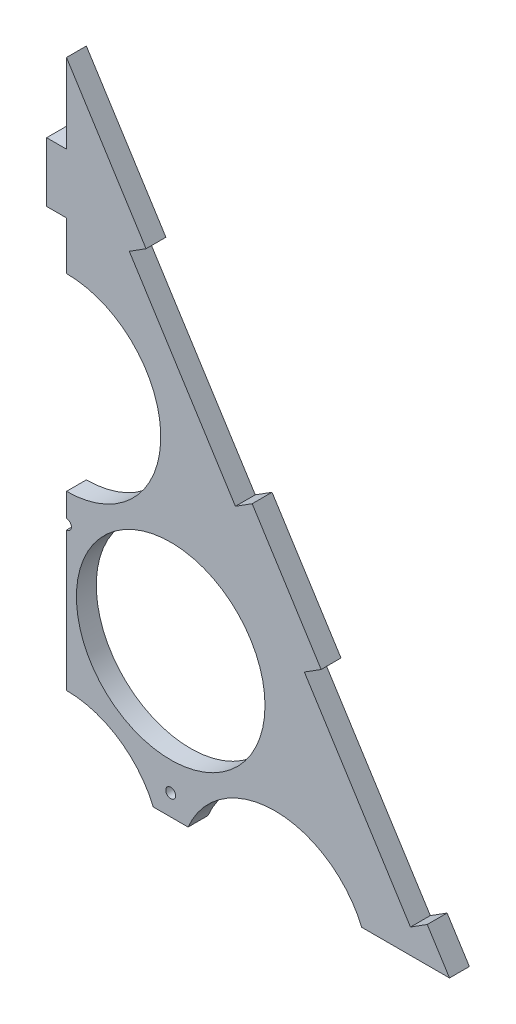
ISO-10303-21;
HEADER;
FILE_DESCRIPTION(('STEP AP214'),'2;1');
FILE_NAME('part.step','',(''),(''),'','','');
FILE_SCHEMA(('AUTOMOTIVE_DESIGN { 1 0 10303 214 1 1 1 1 }'));
ENDSEC;
DATA;
#1=APPLICATION_CONTEXT('core data for automotive mechanical design processes');
#2=APPLICATION_PROTOCOL_DEFINITION('international standard','automotive_design',2000,#1);
#3=PRODUCT_CONTEXT('',#1,'mechanical');
#4=PRODUCT('Part','Part','',(#3));
#5=PRODUCT_RELATED_PRODUCT_CATEGORY('part','',(#4));
#6=PRODUCT_DEFINITION_FORMATION('','',#4);
#7=PRODUCT_DEFINITION_CONTEXT('part definition',#1,'design');
#8=PRODUCT_DEFINITION('design','',#6,#7);
#9=PRODUCT_DEFINITION_SHAPE('','',#8);
#10=(LENGTH_UNIT() NAMED_UNIT(*) SI_UNIT(.MILLI.,.METRE.));
#11=(NAMED_UNIT(*) PLANE_ANGLE_UNIT() SI_UNIT($,.RADIAN.));
#12=(NAMED_UNIT(*) SI_UNIT($,.STERADIAN.) SOLID_ANGLE_UNIT());
#13=UNCERTAINTY_MEASURE_WITH_UNIT(LENGTH_MEASURE(1.E-05),#10,'distance_accuracy_value','');
#14=(GEOMETRIC_REPRESENTATION_CONTEXT(3) GLOBAL_UNCERTAINTY_ASSIGNED_CONTEXT((#13)) GLOBAL_UNIT_ASSIGNED_CONTEXT((#10,
#11,#12)) REPRESENTATION_CONTEXT('',''));
#15=CARTESIAN_POINT('',(0.,0.,0.));
#16=DIRECTION('',(0.,0.,1.));
#17=DIRECTION('',(1.,0.,0.));
#18=AXIS2_PLACEMENT_3D('',#15,#16,#17);
#19=CARTESIAN_POINT('',(0.,414.561180134828,0.));
#20=DIRECTION('',(1.,0.,0.));
#21=DIRECTION('',(0.,1.,0.));
#22=AXIS2_PLACEMENT_3D('',#19,#20,#21);
#23=PLANE('',#22);
#24=DIRECTION('',(0.,1.,0.));
#25=VECTOR('',#24,1.);
#26=CARTESIAN_POINT('',(0.,414.561180134828,10.));
#27=LINE('',#26,#25);
#28=CARTESIAN_POINT('',(0.,320.298002192098,10.));
#29=VERTEX_POINT('',#28);
#30=CARTESIAN_POINT('',(0.,344.561180134828,10.));
#31=VERTEX_POINT('',#30);
#32=EDGE_CURVE('E231',#29,#31,#27,.T.);
#33=ORIENTED_EDGE('',*,*,#32,.T.);
#34=DIRECTION('',(0.,0.,1.));
#35=VECTOR('',#34,1.);
#36=CARTESIAN_POINT('',(0.,344.561180134828,0.));
#37=LINE('',#36,#35);
#38=CARTESIAN_POINT('',(0.,344.561180134828,0.));
#39=VERTEX_POINT('',#38);
#40=EDGE_CURVE('E58',#39,#31,#37,.T.);
#41=ORIENTED_EDGE('',*,*,#40,.F.);
#42=DIRECTION('',(0.,1.,0.));
#43=VECTOR('',#42,1.);
#44=CARTESIAN_POINT('',(0.,414.561180134828,0.));
#45=LINE('',#44,#43);
#46=CARTESIAN_POINT('',(0.,320.298002192098,0.));
#47=VERTEX_POINT('',#46);
#48=EDGE_CURVE('E225',#47,#39,#45,.T.);
#49=ORIENTED_EDGE('',*,*,#48,.F.);
#50=DIRECTION('',(0.,0.,-1.));
#51=VECTOR('',#50,1.);
#52=CARTESIAN_POINT('',(0.,320.298002192098,10.));
#53=LINE('',#52,#51);
#54=EDGE_CURVE('E235',#47,#29,#53,.F.);
#55=ORIENTED_EDGE('',*,*,#54,.T.);
#56=EDGE_LOOP('',(#33,#41,#49,#55));
#57=FACE_BOUND('',#56,.T.);
#58=ADVANCED_FACE('F35',(#57),#23,.F.);
#59=CARTESIAN_POINT('',(0.,414.561180134828,10.));
#60=DIRECTION('',(-0.84517937784663,-0.53448275862069,0.));
#61=DIRECTION('',(0.53448275862069,-0.84517937784663,0.));
#62=AXIS2_PLACEMENT_3D('',#59,#60,#61);
#63=PLANE('',#62);
#64=DIRECTION('',(-0.53448275862069,0.845179377846631,0.));
#65=VECTOR('',#64,1.);
#66=CARTESIAN_POINT('',(0.,414.561180134828,10.));
#67=LINE('',#66,#65);
#68=CARTESIAN_POINT('',(192.942106645631,109.461180134828,10.));
#69=VERTEX_POINT('',#68);
#70=CARTESIAN_POINT('',(181.724137931035,127.200191666974,10.));
#71=VERTEX_POINT('',#70);
#72=EDGE_CURVE('E336',#69,#71,#67,.T.);
#73=ORIENTED_EDGE('',*,*,#72,.F.);
#74=DIRECTION('',(0.,0.,-1.));
#75=VECTOR('',#74,1.);
#76=CARTESIAN_POINT('',(192.942106645631,109.461180134828,10.));
#77=LINE('',#76,#75);
#78=CARTESIAN_POINT('',(192.942106645631,109.461180134828,0.));
#79=VERTEX_POINT('',#78);
#80=EDGE_CURVE('E243',#69,#79,#77,.T.);
#81=ORIENTED_EDGE('',*,*,#80,.T.);
#82=DIRECTION('',(-0.53448275862069,0.845179377846631,0.));
#83=VECTOR('',#82,1.);
#84=CARTESIAN_POINT('',(0.,414.561180134828,0.));
#85=LINE('',#84,#83);
#86=CARTESIAN_POINT('',(181.724137931035,127.200191666974,0.));
#87=VERTEX_POINT('',#86);
#88=EDGE_CURVE('E341',#79,#87,#85,.T.);
#89=ORIENTED_EDGE('',*,*,#88,.T.);
#90=DIRECTION('',(0.,0.,1.));
#91=VECTOR('',#90,1.);
#92=CARTESIAN_POINT('',(181.724137931035,127.200191666974,0.));
#93=LINE('',#92,#91);
#94=EDGE_CURVE('E279',#87,#71,#93,.T.);
#95=ORIENTED_EDGE('',*,*,#94,.T.);
#96=EDGE_LOOP('',(#73,#81,#89,#95));
#97=FACE_BOUND('',#96,.T.);
#98=ADVANCED_FACE('F421',(#97),#63,.F.);
#99=CARTESIAN_POINT('',(128.275862068966,211.718129451637,10.));
#100=VERTEX_POINT('',#99);
#101=CARTESIAN_POINT('',(93.5344827586208,266.654789011668,10.));
#102=VERTEX_POINT('',#101);
#103=EDGE_CURVE('E339',#100,#102,#67,.T.);
#104=ORIENTED_EDGE('',*,*,#103,.F.);
#105=DIRECTION('',(0.,0.,1.));
#106=VECTOR('',#105,1.);
#107=CARTESIAN_POINT('',(128.275862068966,211.718129451637,0.));
#108=LINE('',#107,#106);
#109=CARTESIAN_POINT('',(128.275862068966,211.718129451637,0.));
#110=VERTEX_POINT('',#109);
#111=EDGE_CURVE('E269',#110,#100,#108,.T.);
#112=ORIENTED_EDGE('',*,*,#111,.F.);
#113=CARTESIAN_POINT('',(93.5344827586208,266.654789011668,0.));
#114=VERTEX_POINT('',#113);
#115=EDGE_CURVE('E343',#110,#114,#85,.T.);
#116=ORIENTED_EDGE('',*,*,#115,.T.);
#117=DIRECTION('',(0.,0.,1.));
#118=VECTOR('',#117,1.);
#119=CARTESIAN_POINT('',(93.5344827586208,266.654789011668,0.));
#120=LINE('',#119,#118);
#121=EDGE_CURVE('E274',#114,#102,#120,.T.);
#122=ORIENTED_EDGE('',*,*,#121,.T.);
#123=EDGE_LOOP('',(#104,#112,#116,#122));
#124=FACE_BOUND('',#123,.T.);
#125=ADVANCED_FACE('F400',(#124),#63,.F.);
#126=CARTESIAN_POINT('',(0.,0.,10.));
#127=DIRECTION('',(0.,0.,-1.));
#128=DIRECTION('',(-1.,0.,0.));
#129=AXIS2_PLACEMENT_3D('',#126,#127,#128);
#130=PLANE('',#129);
#131=CARTESIAN_POINT('',(52.5,119.980042493922,10.));
#132=DIRECTION('',(0.,0.,1.));
#133=DIRECTION('',(1.,0.,0.));
#134=AXIS2_PLACEMENT_3D('',#131,#132,#133);
#135=CIRCLE('',#134,2.5);
#136=CARTESIAN_POINT('',(55.,119.980042493922,10.));
#137=VERTEX_POINT('',#136);
#138=EDGE_CURVE('E246',#137,#137,#135,.T.);
#139=ORIENTED_EDGE('',*,*,#138,.F.);
#140=EDGE_LOOP('',(#139));
#141=FACE_BOUND('',#140,.T.);
#142=CARTESIAN_POINT('',(52.5,181.865334794732,10.));
#143=DIRECTION('',(0.,0.,1.));
#144=DIRECTION('',(1.,0.,0.));
#145=AXIS2_PLACEMENT_3D('',#142,#143,#144);
#146=CIRCLE('',#145,47.5);
#147=CARTESIAN_POINT('',(100.,181.865334794732,10.));
#148=VERTEX_POINT('',#147);
#149=EDGE_CURVE('E318',#148,#148,#146,.T.);
#150=ORIENTED_EDGE('',*,*,#149,.F.);
#151=EDGE_LOOP('',(#150));
#152=FACE_BOUND('',#151,.T.);
#153=CARTESIAN_POINT('',(40.0862068965517,351.172726796331,10.));
#154=VERTEX_POINT('',#153);
#155=CARTESIAN_POINT('',(0.,414.561180134828,10.));
#156=VERTEX_POINT('',#155);
#157=EDGE_CURVE('E340',#154,#156,#67,.T.);
#158=ORIENTED_EDGE('',*,*,#157,.T.);
#159=CARTESIAN_POINT('',(0.,374.561180134828,10.));
#160=VERTEX_POINT('',#159);
#161=EDGE_CURVE('E234',#160,#156,#27,.T.);
#162=ORIENTED_EDGE('',*,*,#161,.F.);
#163=DIRECTION('',(-1.,0.,0.));
#164=VECTOR('',#163,1.);
#165=CARTESIAN_POINT('',(0.,374.561180134828,10.));
#166=LINE('',#165,#164);
#167=CARTESIAN_POINT('',(-9.99999999999999,374.561180134828,10.));
#168=VERTEX_POINT('',#167);
#169=EDGE_CURVE('E213',#160,#168,#166,.T.);
#170=ORIENTED_EDGE('',*,*,#169,.T.);
#171=DIRECTION('',(0.,-1.,0.));
#172=VECTOR('',#171,1.);
#173=CARTESIAN_POINT('',(-9.99999999999999,374.561180134828,10.));
#174=LINE('',#173,#172);
#175=CARTESIAN_POINT('',(-9.99999999999998,344.561180134828,10.));
#176=VERTEX_POINT('',#175);
#177=EDGE_CURVE('E190',#168,#176,#174,.T.);
#178=ORIENTED_EDGE('',*,*,#177,.T.);
#179=DIRECTION('',(1.,0.,0.));
#180=VECTOR('',#179,1.);
#181=CARTESIAN_POINT('',(0.,344.561180134828,10.));
#182=LINE('',#181,#180);
#183=EDGE_CURVE('E207',#176,#31,#182,.T.);
#184=ORIENTED_EDGE('',*,*,#183,.T.);
#185=ORIENTED_EDGE('',*,*,#32,.F.);
#186=CARTESIAN_POINT('',(0.,272.798002192098,10.));
#187=DIRECTION('',(0.,0.,1.));
#188=DIRECTION('',(1.,0.,0.));
#189=AXIS2_PLACEMENT_3D('',#186,#187,#188);
#190=CIRCLE('',#189,47.5);
#191=CARTESIAN_POINT('',(0.,225.298002192098,10.));
#192=VERTEX_POINT('',#191);
#193=EDGE_CURVE('E312',#192,#29,#190,.T.);
#194=ORIENTED_EDGE('',*,*,#193,.F.);
#195=CARTESIAN_POINT('',(0.,213.412709891288,10.));
#196=VERTEX_POINT('',#195);
#197=EDGE_CURVE('E233',#196,#192,#27,.T.);
#198=ORIENTED_EDGE('',*,*,#197,.F.);
#199=CARTESIAN_POINT('',(0.,210.912709891288,10.));
#200=DIRECTION('',(0.,0.,1.));
#201=DIRECTION('',(1.,0.,0.));
#202=AXIS2_PLACEMENT_3D('',#199,#200,#201);
#203=CIRCLE('',#202,2.5);
#204=CARTESIAN_POINT('',(0.,208.412709891288,10.));
#205=VERTEX_POINT('',#204);
#206=EDGE_CURVE('E250',#205,#196,#203,.T.);
#207=ORIENTED_EDGE('',*,*,#206,.F.);
#208=CARTESIAN_POINT('',(0.,138.432667397366,10.));
#209=VERTEX_POINT('',#208);
#210=EDGE_CURVE('E224',#209,#205,#27,.T.);
#211=ORIENTED_EDGE('',*,*,#210,.F.);
#212=CARTESIAN_POINT('',(0.,90.932667397366,10.));
#213=DIRECTION('',(0.,0.,1.));
#214=DIRECTION('',(1.,0.,0.));
#215=AXIS2_PLACEMENT_3D('',#212,#213,#214);
#216=CIRCLE('',#215,47.5);
#217=CARTESIAN_POINT('',(43.7372177411607,109.461180134828,10.));
#218=VERTEX_POINT('',#217);
#219=EDGE_CURVE('E330',#218,#209,#216,.T.);
#220=ORIENTED_EDGE('',*,*,#219,.F.);
#221=DIRECTION('',(-1.,0.,0.));
#222=VECTOR('',#221,1.);
#223=CARTESIAN_POINT('',(0.,109.461180134828,10.));
#224=LINE('',#223,#222);
#225=CARTESIAN_POINT('',(61.2627822588393,109.461180134828,10.));
#226=VERTEX_POINT('',#225);
#227=EDGE_CURVE('E217',#226,#218,#224,.T.);
#228=ORIENTED_EDGE('',*,*,#227,.F.);
#229=CARTESIAN_POINT('',(105.,90.932667397366,10.));
#230=DIRECTION('',(0.,0.,1.));
#231=DIRECTION('',(1.,0.,0.));
#232=AXIS2_PLACEMENT_3D('',#229,#230,#231);
#233=CIRCLE('',#232,47.5);
#234=CARTESIAN_POINT('',(148.737217741161,109.461180134828,10.));
#235=VERTEX_POINT('',#234);
#236=EDGE_CURVE('E324',#235,#226,#233,.T.);
#237=ORIENTED_EDGE('',*,*,#236,.F.);
#238=EDGE_CURVE('E230',#69,#235,#224,.T.);
#239=ORIENTED_EDGE('',*,*,#238,.F.);
#240=ORIENTED_EDGE('',*,*,#72,.T.);
#241=DIRECTION('',(0.84517937784663,0.53448275862069,0.));
#242=VECTOR('',#241,1.);
#243=CARTESIAN_POINT('',(181.724137931035,127.200191666974,10.));
#244=LINE('',#243,#242);
#245=CARTESIAN_POINT('',(173.272344152568,121.855364080767,10.));
#246=VERTEX_POINT('',#245);
#247=EDGE_CURVE('E263',#246,#71,#244,.T.);
#248=ORIENTED_EDGE('',*,*,#247,.F.);
#249=DIRECTION('',(0.53448275862069,-0.84517937784663,0.));
#250=VECTOR('',#249,1.);
#251=CARTESIAN_POINT('',(173.272344152568,121.855364080767,10.));
#252=LINE('',#251,#250);
#253=CARTESIAN_POINT('',(119.824068290499,206.37330186543,10.));
#254=VERTEX_POINT('',#253);
#255=EDGE_CURVE('E273',#254,#246,#252,.T.);
#256=ORIENTED_EDGE('',*,*,#255,.F.);
#257=DIRECTION('',(-0.84517937784663,-0.53448275862069,0.));
#258=VECTOR('',#257,1.);
#259=CARTESIAN_POINT('',(119.824068290499,206.37330186543,10.));
#260=LINE('',#259,#258);
#261=EDGE_CURVE('E270',#100,#254,#260,.T.);
#262=ORIENTED_EDGE('',*,*,#261,.F.);
#263=ORIENTED_EDGE('',*,*,#103,.T.);
#264=DIRECTION('',(0.845179377846631,0.534482758620689,0.));
#265=VECTOR('',#264,1.);
#266=CARTESIAN_POINT('',(93.5344827586208,266.654789011668,10.));
#267=LINE('',#266,#265);
#268=CARTESIAN_POINT('',(85.0826889801545,261.309961425461,10.));
#269=VERTEX_POINT('',#268);
#270=EDGE_CURVE('E292',#269,#102,#267,.T.);
#271=ORIENTED_EDGE('',*,*,#270,.F.);
#272=DIRECTION('',(0.534482758620691,-0.84517937784663,0.));
#273=VECTOR('',#272,1.);
#274=CARTESIAN_POINT('',(85.0826889801545,261.309961425461,10.));
#275=LINE('',#274,#273);
#276=CARTESIAN_POINT('',(31.6344131180854,345.827899210124,10.));
#277=VERTEX_POINT('',#276);
#278=EDGE_CURVE('E301',#277,#269,#275,.T.);
#279=ORIENTED_EDGE('',*,*,#278,.F.);
#280=DIRECTION('',(-0.84517937784663,-0.53448275862069,0.));
#281=VECTOR('',#280,1.);
#282=CARTESIAN_POINT('',(31.6344131180854,345.827899210124,10.));
#283=LINE('',#282,#281);
#284=EDGE_CURVE('E256',#154,#277,#283,.T.);
#285=ORIENTED_EDGE('',*,*,#284,.F.);
#286=EDGE_LOOP('',(#158,#162,#170,#178,#184,#185,#194,#198,#207,#211,#220,#228,#237,#239,#240,
#248,#256,#262,#263,#271,#279,#285));
#287=FACE_BOUND('',#286,.T.);
#288=ADVANCED_FACE('F361',(#141,#152,#287),#130,.F.);
#289=CARTESIAN_POINT('',(0.,0.,0.));
#290=DIRECTION('',(0.,0.,-1.));
#291=DIRECTION('',(-1.,0.,0.));
#292=AXIS2_PLACEMENT_3D('',#289,#290,#291);
#293=PLANE('',#292);
#294=ORIENTED_EDGE('',*,*,#48,.T.);
#295=DIRECTION('',(1.,0.,0.));
#296=VECTOR('',#295,1.);
#297=CARTESIAN_POINT('',(0.,344.561180134828,0.));
#298=LINE('',#297,#296);
#299=CARTESIAN_POINT('',(-9.99999999999998,344.561180134828,0.));
#300=VERTEX_POINT('',#299);
#301=EDGE_CURVE('E204',#300,#39,#298,.T.);
#302=ORIENTED_EDGE('',*,*,#301,.F.);
#303=DIRECTION('',(0.,-1.,0.));
#304=VECTOR('',#303,1.);
#305=CARTESIAN_POINT('',(-9.99999999999999,374.561180134828,0.));
#306=LINE('',#305,#304);
#307=CARTESIAN_POINT('',(-9.99999999999999,374.561180134828,0.));
#308=VERTEX_POINT('',#307);
#309=EDGE_CURVE('E187',#308,#300,#306,.T.);
#310=ORIENTED_EDGE('',*,*,#309,.F.);
#311=DIRECTION('',(-1.,0.,0.));
#312=VECTOR('',#311,1.);
#313=CARTESIAN_POINT('',(0.,374.561180134828,0.));
#314=LINE('',#313,#312);
#315=CARTESIAN_POINT('',(0.,374.561180134828,0.));
#316=VERTEX_POINT('',#315);
#317=EDGE_CURVE('E202',#316,#308,#314,.T.);
#318=ORIENTED_EDGE('',*,*,#317,.F.);
#319=CARTESIAN_POINT('',(0.,414.561180134828,0.));
#320=VERTEX_POINT('',#319);
#321=EDGE_CURVE('E50',#316,#320,#45,.T.);
#322=ORIENTED_EDGE('',*,*,#321,.T.);
#323=CARTESIAN_POINT('',(40.0862068965518,351.172726796331,0.));
#324=VERTEX_POINT('',#323);
#325=EDGE_CURVE('E333',#324,#320,#85,.T.);
#326=ORIENTED_EDGE('',*,*,#325,.F.);
#327=DIRECTION('',(-0.84517937784663,-0.53448275862069,0.));
#328=VECTOR('',#327,1.);
#329=CARTESIAN_POINT('',(31.6344131180854,345.827899210124,0.));
#330=LINE('',#329,#328);
#331=CARTESIAN_POINT('',(31.6344131180854,345.827899210124,0.));
#332=VERTEX_POINT('',#331);
#333=EDGE_CURVE('E288',#324,#332,#330,.T.);
#334=ORIENTED_EDGE('',*,*,#333,.T.);
#335=DIRECTION('',(0.534482758620691,-0.84517937784663,0.));
#336=VECTOR('',#335,1.);
#337=CARTESIAN_POINT('',(85.0826889801545,261.309961425461,0.));
#338=LINE('',#337,#336);
#339=CARTESIAN_POINT('',(85.0826889801545,261.309961425461,0.));
#340=VERTEX_POINT('',#339);
#341=EDGE_CURVE('E291',#332,#340,#338,.T.);
#342=ORIENTED_EDGE('',*,*,#341,.T.);
#343=DIRECTION('',(0.845179377846631,0.534482758620689,0.));
#344=VECTOR('',#343,1.);
#345=CARTESIAN_POINT('',(93.5344827586208,266.654789011668,0.));
#346=LINE('',#345,#344);
#347=EDGE_CURVE('E295',#340,#114,#346,.T.);
#348=ORIENTED_EDGE('',*,*,#347,.T.);
#349=ORIENTED_EDGE('',*,*,#115,.F.);
#350=DIRECTION('',(-0.84517937784663,-0.53448275862069,0.));
#351=VECTOR('',#350,1.);
#352=CARTESIAN_POINT('',(119.824068290499,206.37330186543,0.));
#353=LINE('',#352,#351);
#354=CARTESIAN_POINT('',(119.824068290499,206.37330186543,0.));
#355=VERTEX_POINT('',#354);
#356=EDGE_CURVE('E259',#110,#355,#353,.T.);
#357=ORIENTED_EDGE('',*,*,#356,.T.);
#358=DIRECTION('',(0.53448275862069,-0.84517937784663,0.));
#359=VECTOR('',#358,1.);
#360=CARTESIAN_POINT('',(173.272344152568,121.855364080767,0.));
#361=LINE('',#360,#359);
#362=CARTESIAN_POINT('',(173.272344152568,121.855364080767,0.));
#363=VERTEX_POINT('',#362);
#364=EDGE_CURVE('E262',#355,#363,#361,.T.);
#365=ORIENTED_EDGE('',*,*,#364,.T.);
#366=DIRECTION('',(0.84517937784663,0.53448275862069,0.));
#367=VECTOR('',#366,1.);
#368=CARTESIAN_POINT('',(181.724137931035,127.200191666974,0.));
#369=LINE('',#368,#367);
#370=EDGE_CURVE('E266',#363,#87,#369,.T.);
#371=ORIENTED_EDGE('',*,*,#370,.T.);
#372=ORIENTED_EDGE('',*,*,#88,.F.);
#373=DIRECTION('',(-1.,0.,0.));
#374=VECTOR('',#373,1.);
#375=CARTESIAN_POINT('',(0.,109.461180134828,0.));
#376=LINE('',#375,#374);
#377=CARTESIAN_POINT('',(148.737217741161,109.461180134828,0.));
#378=VERTEX_POINT('',#377);
#379=EDGE_CURVE('E223',#79,#378,#376,.T.);
#380=ORIENTED_EDGE('',*,*,#379,.T.);
#381=CARTESIAN_POINT('',(105.,90.932667397366,0.));
#382=DIRECTION('',(0.,0.,1.));
#383=DIRECTION('',(1.,0.,0.));
#384=AXIS2_PLACEMENT_3D('',#381,#382,#383);
#385=CIRCLE('',#384,47.5);
#386=CARTESIAN_POINT('',(61.2627822588393,109.461180134828,0.));
#387=VERTEX_POINT('',#386);
#388=EDGE_CURVE('E321',#378,#387,#385,.T.);
#389=ORIENTED_EDGE('',*,*,#388,.T.);
#390=CARTESIAN_POINT('',(43.7372177411607,109.461180134828,0.));
#391=VERTEX_POINT('',#390);
#392=EDGE_CURVE('E220',#387,#391,#376,.T.);
#393=ORIENTED_EDGE('',*,*,#392,.T.);
#394=CARTESIAN_POINT('',(0.,90.932667397366,0.));
#395=DIRECTION('',(0.,0.,1.));
#396=DIRECTION('',(1.,0.,0.));
#397=AXIS2_PLACEMENT_3D('',#394,#395,#396);
#398=CIRCLE('',#397,47.5);
#399=CARTESIAN_POINT('',(0.,138.432667397366,0.));
#400=VERTEX_POINT('',#399);
#401=EDGE_CURVE('E327',#391,#400,#398,.T.);
#402=ORIENTED_EDGE('',*,*,#401,.T.);
#403=CARTESIAN_POINT('',(0.,208.412709891288,0.));
#404=VERTEX_POINT('',#403);
#405=EDGE_CURVE('E228',#400,#404,#45,.T.);
#406=ORIENTED_EDGE('',*,*,#405,.T.);
#407=CARTESIAN_POINT('',(0.,210.912709891288,0.));
#408=DIRECTION('',(0.,0.,1.));
#409=DIRECTION('',(1.,0.,0.));
#410=AXIS2_PLACEMENT_3D('',#407,#408,#409);
#411=CIRCLE('',#410,2.5);
#412=CARTESIAN_POINT('',(0.,213.412709891288,0.));
#413=VERTEX_POINT('',#412);
#414=EDGE_CURVE('E253',#404,#413,#411,.T.);
#415=ORIENTED_EDGE('',*,*,#414,.T.);
#416=CARTESIAN_POINT('',(0.,225.298002192098,0.));
#417=VERTEX_POINT('',#416);
#418=EDGE_CURVE('E227',#413,#417,#45,.T.);
#419=ORIENTED_EDGE('',*,*,#418,.T.);
#420=CARTESIAN_POINT('',(0.,272.798002192098,0.));
#421=DIRECTION('',(0.,0.,1.));
#422=DIRECTION('',(1.,0.,0.));
#423=AXIS2_PLACEMENT_3D('',#420,#421,#422);
#424=CIRCLE('',#423,47.5);
#425=EDGE_CURVE('E282',#417,#47,#424,.T.);
#426=ORIENTED_EDGE('',*,*,#425,.T.);
#427=EDGE_LOOP('',(#294,#302,#310,#318,#322,#326,#334,#342,#348,#349,#357,#365,#371,#372,#380,
#389,#393,#402,#406,#415,#419,#426));
#428=FACE_BOUND('',#427,.T.);
#429=CARTESIAN_POINT('',(52.5,119.980042493922,0.));
#430=DIRECTION('',(0.,0.,1.));
#431=DIRECTION('',(1.,0.,0.));
#432=AXIS2_PLACEMENT_3D('',#429,#430,#431);
#433=CIRCLE('',#432,2.5);
#434=CARTESIAN_POINT('',(55.,119.980042493922,0.));
#435=VERTEX_POINT('',#434);
#436=EDGE_CURVE('E247',#435,#435,#433,.T.);
#437=ORIENTED_EDGE('',*,*,#436,.T.);
#438=EDGE_LOOP('',(#437));
#439=FACE_BOUND('',#438,.T.);
#440=CARTESIAN_POINT('',(52.5,181.865334794732,0.));
#441=DIRECTION('',(0.,0.,1.));
#442=DIRECTION('',(1.,0.,0.));
#443=AXIS2_PLACEMENT_3D('',#440,#441,#442);
#444=CIRCLE('',#443,47.5);
#445=CARTESIAN_POINT('',(100.,181.865334794732,0.));
#446=VERTEX_POINT('',#445);
#447=EDGE_CURVE('E315',#446,#446,#444,.T.);
#448=ORIENTED_EDGE('',*,*,#447,.T.);
#449=EDGE_LOOP('',(#448));
#450=FACE_BOUND('',#449,.T.);
#451=ADVANCED_FACE('F200',(#428,#439,#450),#293,.T.);
#452=ORIENTED_EDGE('',*,*,#157,.F.);
#453=DIRECTION('',(0.,0.,1.));
#454=VECTOR('',#453,1.);
#455=CARTESIAN_POINT('',(40.0862068965517,351.172726796331,0.));
#456=LINE('',#455,#454);
#457=EDGE_CURVE('E298',#324,#154,#456,.T.);
#458=ORIENTED_EDGE('',*,*,#457,.F.);
#459=ORIENTED_EDGE('',*,*,#325,.T.);
#460=DIRECTION('',(0.,0.,-1.));
#461=VECTOR('',#460,1.);
#462=CARTESIAN_POINT('',(0.,414.561180134828,10.));
#463=LINE('',#462,#461);
#464=EDGE_CURVE('E338',#156,#320,#463,.T.);
#465=ORIENTED_EDGE('',*,*,#464,.F.);
#466=EDGE_LOOP('',(#452,#458,#459,#465));
#467=FACE_BOUND('',#466,.T.);
#468=ADVANCED_FACE('F37',(#467),#63,.F.);
#469=CARTESIAN_POINT('',(0.,90.932667397366,10.));
#470=DIRECTION('',(0.,0.,-1.));
#471=DIRECTION('',(-1.,0.,0.));
#472=AXIS2_PLACEMENT_3D('',#469,#470,#471);
#473=CYLINDRICAL_SURFACE('',#472,47.5);
#474=DIRECTION('',(0.,0.,-1.));
#475=VECTOR('',#474,1.);
#476=CARTESIAN_POINT('',(0.,138.432667397366,10.));
#477=LINE('',#476,#475);
#478=EDGE_CURVE('E239',#400,#209,#477,.F.);
#479=ORIENTED_EDGE('',*,*,#478,.F.);
#480=ORIENTED_EDGE('',*,*,#401,.F.);
#481=DIRECTION('',(0.,0.,-1.));
#482=VECTOR('',#481,1.);
#483=CARTESIAN_POINT('',(43.7372177411607,109.461180134828,10.));
#484=LINE('',#483,#482);
#485=EDGE_CURVE('E241',#218,#391,#484,.T.);
#486=ORIENTED_EDGE('',*,*,#485,.F.);
#487=ORIENTED_EDGE('',*,*,#219,.T.);
#488=EDGE_LOOP('',(#479,#480,#486,#487));
#489=FACE_BOUND('',#488,.T.);
#490=ADVANCED_FACE('F430',(#489),#473,.F.);
#491=CARTESIAN_POINT('',(105.,90.932667397366,10.));
#492=DIRECTION('',(0.,0.,-1.));
#493=DIRECTION('',(-1.,0.,0.));
#494=AXIS2_PLACEMENT_3D('',#491,#492,#493);
#495=CYLINDRICAL_SURFACE('',#494,47.5);
#496=DIRECTION('',(0.,0.,-1.));
#497=VECTOR('',#496,1.);
#498=CARTESIAN_POINT('',(148.737217741161,109.461180134828,10.));
#499=LINE('',#498,#497);
#500=EDGE_CURVE('E11',#235,#378,#499,.T.);
#501=ORIENTED_EDGE('',*,*,#500,.F.);
#502=ORIENTED_EDGE('',*,*,#236,.T.);
#503=DIRECTION('',(0.,0.,-1.));
#504=VECTOR('',#503,1.);
#505=CARTESIAN_POINT('',(61.2627822588393,109.461180134828,10.));
#506=LINE('',#505,#504);
#507=EDGE_CURVE('E43',#387,#226,#506,.F.);
#508=ORIENTED_EDGE('',*,*,#507,.F.);
#509=ORIENTED_EDGE('',*,*,#388,.F.);
#510=EDGE_LOOP('',(#501,#502,#508,#509));
#511=FACE_BOUND('',#510,.T.);
#512=ADVANCED_FACE('F365',(#511),#495,.F.);
#513=CARTESIAN_POINT('',(52.5,181.865334794732,10.));
#514=DIRECTION('',(0.,0.,-1.));
#515=DIRECTION('',(-1.,0.,0.));
#516=AXIS2_PLACEMENT_3D('',#513,#514,#515);
#517=CYLINDRICAL_SURFACE('',#516,47.5);
#518=ORIENTED_EDGE('',*,*,#149,.T.);
#519=EDGE_LOOP('',(#518));
#520=FACE_BOUND('',#519,.T.);
#521=ORIENTED_EDGE('',*,*,#447,.F.);
#522=EDGE_LOOP('',(#521));
#523=FACE_BOUND('',#522,.T.);
#524=ADVANCED_FACE('F446',(#520,#523),#517,.F.);
#525=CARTESIAN_POINT('',(0.,272.798002192098,10.));
#526=DIRECTION('',(0.,0.,-1.));
#527=DIRECTION('',(-1.,0.,0.));
#528=AXIS2_PLACEMENT_3D('',#525,#526,#527);
#529=CYLINDRICAL_SURFACE('',#528,47.5);
#530=DIRECTION('',(0.,0.,-1.));
#531=VECTOR('',#530,1.);
#532=CARTESIAN_POINT('',(0.,225.298002192098,10.));
#533=LINE('',#532,#531);
#534=EDGE_CURVE('E237',#192,#417,#533,.T.);
#535=ORIENTED_EDGE('',*,*,#534,.F.);
#536=ORIENTED_EDGE('',*,*,#193,.T.);
#537=ORIENTED_EDGE('',*,*,#54,.F.);
#538=ORIENTED_EDGE('',*,*,#425,.F.);
#539=EDGE_LOOP('',(#535,#536,#537,#538));
#540=FACE_BOUND('',#539,.T.);
#541=ADVANCED_FACE('F449',(#540),#529,.F.);
#542=CARTESIAN_POINT('',(93.5344827586208,266.654789011668,0.));
#543=DIRECTION('',(0.534482758620689,-0.845179377846631,0.));
#544=DIRECTION('',(0.845179377846631,0.534482758620689,0.));
#545=AXIS2_PLACEMENT_3D('',#542,#543,#544);
#546=PLANE('',#545);
#547=ORIENTED_EDGE('',*,*,#270,.T.);
#548=ORIENTED_EDGE('',*,*,#121,.F.);
#549=ORIENTED_EDGE('',*,*,#347,.F.);
#550=DIRECTION('',(0.,0.,1.));
#551=VECTOR('',#550,1.);
#552=CARTESIAN_POINT('',(85.0826889801545,261.309961425461,0.));
#553=LINE('',#552,#551);
#554=EDGE_CURVE('E307',#340,#269,#553,.T.);
#555=ORIENTED_EDGE('',*,*,#554,.T.);
#556=EDGE_LOOP('',(#547,#548,#549,#555));
#557=FACE_BOUND('',#556,.T.);
#558=ADVANCED_FACE('F405',(#557),#546,.F.);
#559=CARTESIAN_POINT('',(85.0826889801545,261.309961425461,0.));
#560=DIRECTION('',(-0.84517937784663,-0.534482758620691,0.));
#561=DIRECTION('',(0.534482758620691,-0.84517937784663,0.));
#562=AXIS2_PLACEMENT_3D('',#559,#560,#561);
#563=PLANE('',#562);
#564=ORIENTED_EDGE('',*,*,#278,.T.);
#565=ORIENTED_EDGE('',*,*,#554,.F.);
#566=ORIENTED_EDGE('',*,*,#341,.F.);
#567=DIRECTION('',(0.,0.,1.));
#568=VECTOR('',#567,1.);
#569=CARTESIAN_POINT('',(31.6344131180854,345.827899210124,0.));
#570=LINE('',#569,#568);
#571=EDGE_CURVE('E309',#332,#277,#570,.T.);
#572=ORIENTED_EDGE('',*,*,#571,.T.);
#573=EDGE_LOOP('',(#564,#565,#566,#572));
#574=FACE_BOUND('',#573,.T.);
#575=ADVANCED_FACE('F457',(#574),#563,.F.);
#576=CARTESIAN_POINT('',(31.6344131180854,345.827899210124,0.));
#577=DIRECTION('',(-0.53448275862069,0.84517937784663,0.));
#578=DIRECTION('',(-0.84517937784663,-0.53448275862069,0.));
#579=AXIS2_PLACEMENT_3D('',#576,#577,#578);
#580=PLANE('',#579);
#581=ORIENTED_EDGE('',*,*,#284,.T.);
#582=ORIENTED_EDGE('',*,*,#571,.F.);
#583=ORIENTED_EDGE('',*,*,#333,.F.);
#584=ORIENTED_EDGE('',*,*,#457,.T.);
#585=EDGE_LOOP('',(#581,#582,#583,#584));
#586=FACE_BOUND('',#585,.T.);
#587=ADVANCED_FACE('F454',(#586),#580,.F.);
#588=CARTESIAN_POINT('',(181.724137931035,127.200191666974,0.));
#589=DIRECTION('',(0.53448275862069,-0.84517937784663,0.));
#590=DIRECTION('',(0.84517937784663,0.53448275862069,0.));
#591=AXIS2_PLACEMENT_3D('',#588,#589,#590);
#592=PLANE('',#591);
#593=ORIENTED_EDGE('',*,*,#247,.T.);
#594=ORIENTED_EDGE('',*,*,#94,.F.);
#595=ORIENTED_EDGE('',*,*,#370,.F.);
#596=DIRECTION('',(0.,0.,1.));
#597=VECTOR('',#596,1.);
#598=CARTESIAN_POINT('',(173.272344152568,121.855364080767,0.));
#599=LINE('',#598,#597);
#600=EDGE_CURVE('E283',#363,#246,#599,.T.);
#601=ORIENTED_EDGE('',*,*,#600,.T.);
#602=EDGE_LOOP('',(#593,#594,#595,#601));
#603=FACE_BOUND('',#602,.T.);
#604=ADVANCED_FACE('F418',(#603),#592,.F.);
#605=CARTESIAN_POINT('',(173.272344152568,121.855364080767,0.));
#606=DIRECTION('',(-0.84517937784663,-0.53448275862069,0.));
#607=DIRECTION('',(0.534482758620691,-0.84517937784663,0.));
#608=AXIS2_PLACEMENT_3D('',#605,#606,#607);
#609=PLANE('',#608);
#610=ORIENTED_EDGE('',*,*,#255,.T.);
#611=ORIENTED_EDGE('',*,*,#600,.F.);
#612=ORIENTED_EDGE('',*,*,#364,.F.);
#613=DIRECTION('',(0.,0.,1.));
#614=VECTOR('',#613,1.);
#615=CARTESIAN_POINT('',(119.824068290499,206.37330186543,0.));
#616=LINE('',#615,#614);
#617=EDGE_CURVE('E285',#355,#254,#616,.T.);
#618=ORIENTED_EDGE('',*,*,#617,.T.);
#619=EDGE_LOOP('',(#610,#611,#612,#618));
#620=FACE_BOUND('',#619,.T.);
#621=ADVANCED_FACE('F414',(#620),#609,.F.);
#622=CARTESIAN_POINT('',(119.824068290499,206.37330186543,0.));
#623=DIRECTION('',(-0.53448275862069,0.84517937784663,0.));
#624=DIRECTION('',(-0.84517937784663,-0.53448275862069,0.));
#625=AXIS2_PLACEMENT_3D('',#622,#623,#624);
#626=PLANE('',#625);
#627=ORIENTED_EDGE('',*,*,#261,.T.);
#628=ORIENTED_EDGE('',*,*,#617,.F.);
#629=ORIENTED_EDGE('',*,*,#356,.F.);
#630=ORIENTED_EDGE('',*,*,#111,.T.);
#631=EDGE_LOOP('',(#627,#628,#629,#630));
#632=FACE_BOUND('',#631,.T.);
#633=ADVANCED_FACE('F411',(#632),#626,.F.);
#634=CARTESIAN_POINT('',(0.,210.912709891288,0.));
#635=DIRECTION('',(0.,0.,1.));
#636=DIRECTION('',(1.,0.,0.));
#637=AXIS2_PLACEMENT_3D('',#634,#635,#636);
#638=CYLINDRICAL_SURFACE('',#637,2.5);
#639=ORIENTED_EDGE('',*,*,#206,.T.);
#640=DIRECTION('',(0.,0.,1.));
#641=VECTOR('',#640,1.);
#642=CARTESIAN_POINT('',(0.,213.412709891288,0.));
#643=LINE('',#642,#641);
#644=EDGE_CURVE('E348',#196,#413,#643,.F.);
#645=ORIENTED_EDGE('',*,*,#644,.T.);
#646=ORIENTED_EDGE('',*,*,#414,.F.);
#647=DIRECTION('',(0.,0.,1.));
#648=VECTOR('',#647,1.);
#649=CARTESIAN_POINT('',(0.,208.412709891288,0.));
#650=LINE('',#649,#648);
#651=EDGE_CURVE('E345',#404,#205,#650,.T.);
#652=ORIENTED_EDGE('',*,*,#651,.T.);
#653=EDGE_LOOP('',(#639,#645,#646,#652));
#654=FACE_BOUND('',#653,.T.);
#655=ADVANCED_FACE('F379',(#654),#638,.F.);
#656=CARTESIAN_POINT('',(52.5,119.980042493922,0.));
#657=DIRECTION('',(0.,0.,1.));
#658=DIRECTION('',(1.,0.,0.));
#659=AXIS2_PLACEMENT_3D('',#656,#657,#658);
#660=CYLINDRICAL_SURFACE('',#659,2.5);
#661=ORIENTED_EDGE('',*,*,#436,.F.);
#662=EDGE_LOOP('',(#661));
#663=FACE_BOUND('',#662,.T.);
#664=ORIENTED_EDGE('',*,*,#138,.T.);
#665=EDGE_LOOP('',(#664));
#666=FACE_BOUND('',#665,.T.);
#667=ADVANCED_FACE('F472',(#663,#666),#660,.F.);
#668=ORIENTED_EDGE('',*,*,#478,.T.);
#669=ORIENTED_EDGE('',*,*,#210,.T.);
#670=ORIENTED_EDGE('',*,*,#651,.F.);
#671=ORIENTED_EDGE('',*,*,#405,.F.);
#672=EDGE_LOOP('',(#668,#669,#670,#671));
#673=FACE_BOUND('',#672,.T.);
#674=ADVANCED_FACE('F475',(#673),#23,.F.);
#675=ORIENTED_EDGE('',*,*,#534,.T.);
#676=ORIENTED_EDGE('',*,*,#418,.F.);
#677=ORIENTED_EDGE('',*,*,#644,.F.);
#678=ORIENTED_EDGE('',*,*,#197,.T.);
#679=EDGE_LOOP('',(#675,#676,#677,#678));
#680=FACE_BOUND('',#679,.T.);
#681=ADVANCED_FACE('F383',(#680),#23,.F.);
#682=ORIENTED_EDGE('',*,*,#321,.F.);
#683=DIRECTION('',(0.,0.,1.));
#684=VECTOR('',#683,1.);
#685=CARTESIAN_POINT('',(0.,374.561180134828,0.));
#686=LINE('',#685,#684);
#687=EDGE_CURVE('E196',#316,#160,#686,.T.);
#688=ORIENTED_EDGE('',*,*,#687,.T.);
#689=ORIENTED_EDGE('',*,*,#161,.T.);
#690=ORIENTED_EDGE('',*,*,#464,.T.);
#691=EDGE_LOOP('',(#682,#688,#689,#690));
#692=FACE_BOUND('',#691,.T.);
#693=ADVANCED_FACE('F387',(#692),#23,.F.);
#694=CARTESIAN_POINT('',(0.,109.461180134828,0.));
#695=DIRECTION('',(0.,1.,0.));
#696=DIRECTION('',(0.,0.,1.));
#697=AXIS2_PLACEMENT_3D('',#694,#695,#696);
#698=PLANE('',#697);
#699=ORIENTED_EDGE('',*,*,#485,.T.);
#700=ORIENTED_EDGE('',*,*,#392,.F.);
#701=ORIENTED_EDGE('',*,*,#507,.T.);
#702=ORIENTED_EDGE('',*,*,#227,.T.);
#703=EDGE_LOOP('',(#699,#700,#701,#702));
#704=FACE_BOUND('',#703,.T.);
#705=ADVANCED_FACE('F353',(#704),#698,.F.);
#706=ORIENTED_EDGE('',*,*,#238,.T.);
#707=ORIENTED_EDGE('',*,*,#500,.T.);
#708=ORIENTED_EDGE('',*,*,#379,.F.);
#709=ORIENTED_EDGE('',*,*,#80,.F.);
#710=EDGE_LOOP('',(#706,#707,#708,#709));
#711=FACE_BOUND('',#710,.T.);
#712=ADVANCED_FACE('F368',(#711),#698,.F.);
#713=CARTESIAN_POINT('',(0.,344.561180134828,0.));
#714=DIRECTION('',(0.,-1.,0.));
#715=DIRECTION('',(0.,0.,-1.));
#716=AXIS2_PLACEMENT_3D('',#713,#714,#715);
#717=PLANE('',#716);
#718=ORIENTED_EDGE('',*,*,#183,.F.);
#719=DIRECTION('',(0.,0.,1.));
#720=VECTOR('',#719,1.);
#721=CARTESIAN_POINT('',(-9.99999999999998,344.561180134828,0.));
#722=LINE('',#721,#720);
#723=EDGE_CURVE('E195',#300,#176,#722,.T.);
#724=ORIENTED_EDGE('',*,*,#723,.F.);
#725=ORIENTED_EDGE('',*,*,#301,.T.);
#726=ORIENTED_EDGE('',*,*,#40,.T.);
#727=EDGE_LOOP('',(#718,#724,#725,#726));
#728=FACE_BOUND('',#727,.T.);
#729=ADVANCED_FACE('F484',(#728),#717,.T.);
#730=CARTESIAN_POINT('',(-9.99999999999999,374.561180134828,0.));
#731=DIRECTION('',(-1.,0.,0.));
#732=DIRECTION('',(0.,-1.,0.));
#733=AXIS2_PLACEMENT_3D('',#730,#731,#732);
#734=PLANE('',#733);
#735=ORIENTED_EDGE('',*,*,#177,.F.);
#736=DIRECTION('',(0.,0.,1.));
#737=VECTOR('',#736,1.);
#738=CARTESIAN_POINT('',(-9.99999999999999,374.561180134828,0.));
#739=LINE('',#738,#737);
#740=EDGE_CURVE('E184',#308,#168,#739,.T.);
#741=ORIENTED_EDGE('',*,*,#740,.F.);
#742=ORIENTED_EDGE('',*,*,#309,.T.);
#743=ORIENTED_EDGE('',*,*,#723,.T.);
#744=EDGE_LOOP('',(#735,#741,#742,#743));
#745=FACE_BOUND('',#744,.T.);
#746=ADVANCED_FACE('F186',(#745),#734,.T.);
#747=CARTESIAN_POINT('',(0.,374.561180134828,0.));
#748=DIRECTION('',(0.,1.,0.));
#749=DIRECTION('',(0.,0.,1.));
#750=AXIS2_PLACEMENT_3D('',#747,#748,#749);
#751=PLANE('',#750);
#752=ORIENTED_EDGE('',*,*,#169,.F.);
#753=ORIENTED_EDGE('',*,*,#687,.F.);
#754=ORIENTED_EDGE('',*,*,#317,.T.);
#755=ORIENTED_EDGE('',*,*,#740,.T.);
#756=EDGE_LOOP('',(#752,#753,#754,#755));
#757=FACE_BOUND('',#756,.T.);
#758=ADVANCED_FACE('F206',(#757),#751,.T.);
#759=CLOSED_SHELL('',(#58,#98,#125,#288,#451,#468,#490,#512,#524,#541,#558,#575,#587,#604,#621,
#633,#655,#667,#674,#681,#693,#705,#712,#729,#746,#758));
#760=MANIFOLD_SOLID_BREP('B2',#759);
#761=ADVANCED_BREP_SHAPE_REPRESENTATION('',(#18,#760),#14);
#762=SHAPE_DEFINITION_REPRESENTATION(#9,#761);
ENDSEC;
END-ISO-10303-21;
